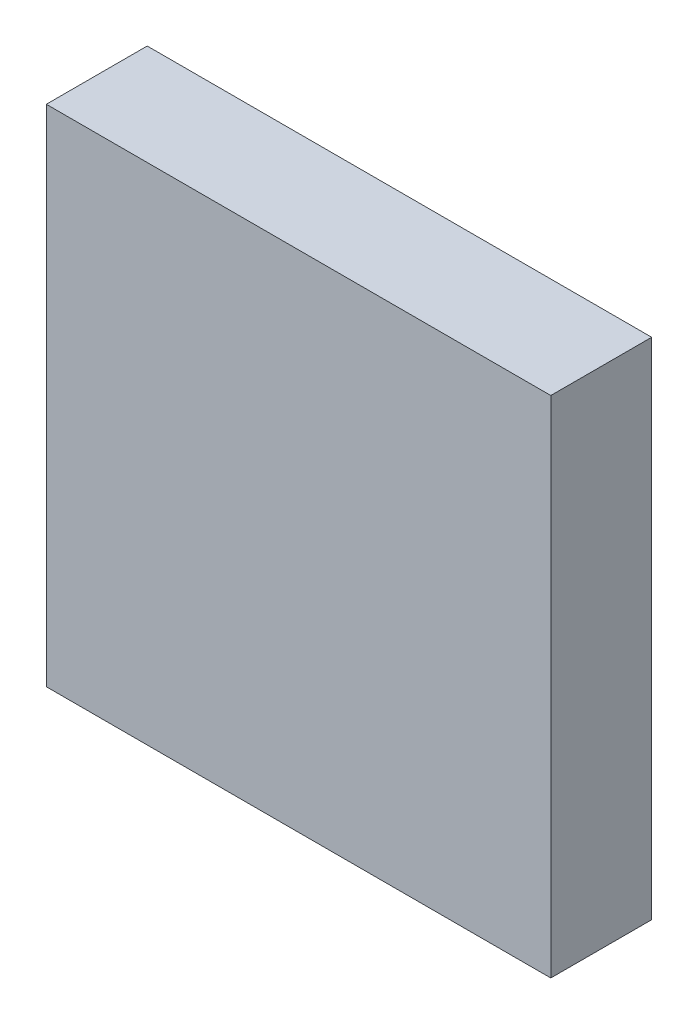
ISO-10303-21;
HEADER;
FILE_DESCRIPTION(('STEP AP214'),'2;1');
FILE_NAME('part.step','',(''),(''),'','','');
FILE_SCHEMA(('AUTOMOTIVE_DESIGN { 1 0 10303 214 1 1 1 1 }'));
ENDSEC;
DATA;
#1=APPLICATION_CONTEXT('core data for automotive mechanical design processes');
#2=APPLICATION_PROTOCOL_DEFINITION('international standard','automotive_design',2000,#1);
#3=PRODUCT_CONTEXT('',#1,'mechanical');
#4=PRODUCT('Part','Part','',(#3));
#5=PRODUCT_RELATED_PRODUCT_CATEGORY('part','',(#4));
#6=PRODUCT_DEFINITION_FORMATION('','',#4);
#7=PRODUCT_DEFINITION_CONTEXT('part definition',#1,'design');
#8=PRODUCT_DEFINITION('design','',#6,#7);
#9=PRODUCT_DEFINITION_SHAPE('','',#8);
#10=(LENGTH_UNIT() NAMED_UNIT(*) SI_UNIT(.MILLI.,.METRE.));
#11=(NAMED_UNIT(*) PLANE_ANGLE_UNIT() SI_UNIT($,.RADIAN.));
#12=(NAMED_UNIT(*) SI_UNIT($,.STERADIAN.) SOLID_ANGLE_UNIT());
#13=UNCERTAINTY_MEASURE_WITH_UNIT(LENGTH_MEASURE(1.E-05),#10,'distance_accuracy_value','');
#14=(GEOMETRIC_REPRESENTATION_CONTEXT(3) GLOBAL_UNCERTAINTY_ASSIGNED_CONTEXT((#13)) GLOBAL_UNIT_ASSIGNED_CONTEXT((#10,
#11,#12)) REPRESENTATION_CONTEXT('',''));
#15=CARTESIAN_POINT('',(0.,0.,0.));
#16=DIRECTION('',(0.,0.,1.));
#17=DIRECTION('',(1.,0.,0.));
#18=AXIS2_PLACEMENT_3D('',#15,#16,#17);
#19=CARTESIAN_POINT('',(10.,10.,4.));
#20=DIRECTION('',(-1.,0.,0.));
#21=DIRECTION('',(0.,0.,1.));
#22=AXIS2_PLACEMENT_3D('',#19,#20,#21);
#23=PLANE('',#22);
#24=DIRECTION('',(0.,1.,0.));
#25=VECTOR('',#24,1.);
#26=CARTESIAN_POINT('',(10.,10.,0.));
#27=LINE('',#26,#25);
#28=CARTESIAN_POINT('',(10.,-10.,0.));
#29=VERTEX_POINT('',#28);
#30=CARTESIAN_POINT('',(10.,10.,0.));
#31=VERTEX_POINT('',#30);
#32=EDGE_CURVE('E100',#29,#31,#27,.T.);
#33=ORIENTED_EDGE('',*,*,#32,.T.);
#34=DIRECTION('',(0.,0.,-1.));
#35=VECTOR('',#34,1.);
#36=CARTESIAN_POINT('',(10.,10.,4.));
#37=LINE('',#36,#35);
#38=CARTESIAN_POINT('',(10.,10.,4.));
#39=VERTEX_POINT('',#38);
#40=EDGE_CURVE('E11',#39,#31,#37,.T.);
#41=ORIENTED_EDGE('',*,*,#40,.F.);
#42=DIRECTION('',(0.,1.,0.));
#43=VECTOR('',#42,1.);
#44=CARTESIAN_POINT('',(10.,10.,4.));
#45=LINE('',#44,#43);
#46=CARTESIAN_POINT('',(10.,-10.,4.));
#47=VERTEX_POINT('',#46);
#48=EDGE_CURVE('E88',#47,#39,#45,.T.);
#49=ORIENTED_EDGE('',*,*,#48,.F.);
#50=DIRECTION('',(0.,0.,-1.));
#51=VECTOR('',#50,1.);
#52=CARTESIAN_POINT('',(10.,-10.,4.));
#53=LINE('',#52,#51);
#54=EDGE_CURVE('E96',#47,#29,#53,.T.);
#55=ORIENTED_EDGE('',*,*,#54,.T.);
#56=EDGE_LOOP('',(#33,#41,#49,#55));
#57=FACE_BOUND('',#56,.T.);
#58=ADVANCED_FACE('F37',(#57),#23,.F.);
#59=CARTESIAN_POINT('',(-10.,10.,4.));
#60=DIRECTION('',(0.,-1.,0.));
#61=DIRECTION('',(0.,0.,-1.));
#62=AXIS2_PLACEMENT_3D('',#59,#60,#61);
#63=PLANE('',#62);
#64=DIRECTION('',(-1.,0.,0.));
#65=VECTOR('',#64,1.);
#66=CARTESIAN_POINT('',(-10.,10.,0.));
#67=LINE('',#66,#65);
#68=CARTESIAN_POINT('',(-10.,10.,0.));
#69=VERTEX_POINT('',#68);
#70=EDGE_CURVE('E92',#31,#69,#67,.T.);
#71=ORIENTED_EDGE('',*,*,#70,.T.);
#72=DIRECTION('',(0.,0.,-1.));
#73=VECTOR('',#72,1.);
#74=CARTESIAN_POINT('',(-10.,10.,4.));
#75=LINE('',#74,#73);
#76=CARTESIAN_POINT('',(-10.,10.,4.));
#77=VERTEX_POINT('',#76);
#78=EDGE_CURVE('E45',#77,#69,#75,.T.);
#79=ORIENTED_EDGE('',*,*,#78,.F.);
#80=DIRECTION('',(-1.,0.,0.));
#81=VECTOR('',#80,1.);
#82=CARTESIAN_POINT('',(-10.,10.,4.));
#83=LINE('',#82,#81);
#84=EDGE_CURVE('E83',#39,#77,#83,.T.);
#85=ORIENTED_EDGE('',*,*,#84,.F.);
#86=ORIENTED_EDGE('',*,*,#40,.T.);
#87=EDGE_LOOP('',(#71,#79,#85,#86));
#88=FACE_BOUND('',#87,.T.);
#89=ADVANCED_FACE('F91',(#88),#63,.F.);
#90=CARTESIAN_POINT('',(-10.,10.,4.));
#91=DIRECTION('',(1.,0.,0.));
#92=DIRECTION('',(0.,1.,0.));
#93=AXIS2_PLACEMENT_3D('',#90,#91,#92);
#94=PLANE('',#93);
#95=DIRECTION('',(0.,-1.,0.));
#96=VECTOR('',#95,1.);
#97=CARTESIAN_POINT('',(-10.,10.,0.));
#98=LINE('',#97,#96);
#99=CARTESIAN_POINT('',(-10.,-10.,0.));
#100=VERTEX_POINT('',#99);
#101=EDGE_CURVE('E70',#69,#100,#98,.T.);
#102=ORIENTED_EDGE('',*,*,#101,.T.);
#103=DIRECTION('',(0.,0.,-1.));
#104=VECTOR('',#103,1.);
#105=CARTESIAN_POINT('',(-10.,-10.,4.));
#106=LINE('',#105,#104);
#107=CARTESIAN_POINT('',(-10.,-10.,4.));
#108=VERTEX_POINT('',#107);
#109=EDGE_CURVE('E93',#108,#100,#106,.T.);
#110=ORIENTED_EDGE('',*,*,#109,.F.);
#111=DIRECTION('',(0.,-1.,0.));
#112=VECTOR('',#111,1.);
#113=CARTESIAN_POINT('',(-10.,10.,4.));
#114=LINE('',#113,#112);
#115=EDGE_CURVE('E86',#77,#108,#114,.T.);
#116=ORIENTED_EDGE('',*,*,#115,.F.);
#117=ORIENTED_EDGE('',*,*,#78,.T.);
#118=EDGE_LOOP('',(#102,#110,#116,#117));
#119=FACE_BOUND('',#118,.T.);
#120=ADVANCED_FACE('F94',(#119),#94,.F.);
#121=CARTESIAN_POINT('',(-10.,-10.,4.));
#122=DIRECTION('',(0.,1.,0.));
#123=DIRECTION('',(0.,0.,1.));
#124=AXIS2_PLACEMENT_3D('',#121,#122,#123);
#125=PLANE('',#124);
#126=DIRECTION('',(1.,0.,0.));
#127=VECTOR('',#126,1.);
#128=CARTESIAN_POINT('',(-10.,-10.,0.));
#129=LINE('',#128,#127);
#130=EDGE_CURVE('E76',#100,#29,#129,.T.);
#131=ORIENTED_EDGE('',*,*,#130,.T.);
#132=ORIENTED_EDGE('',*,*,#54,.F.);
#133=DIRECTION('',(1.,0.,0.));
#134=VECTOR('',#133,1.);
#135=CARTESIAN_POINT('',(-10.,-10.,4.));
#136=LINE('',#135,#134);
#137=EDGE_CURVE('E53',#108,#47,#136,.T.);
#138=ORIENTED_EDGE('',*,*,#137,.F.);
#139=ORIENTED_EDGE('',*,*,#109,.T.);
#140=EDGE_LOOP('',(#131,#132,#138,#139));
#141=FACE_BOUND('',#140,.T.);
#142=ADVANCED_FACE('F107',(#141),#125,.F.);
#143=CARTESIAN_POINT('',(0.,0.,4.));
#144=DIRECTION('',(0.,0.,1.));
#145=DIRECTION('',(1.,0.,0.));
#146=AXIS2_PLACEMENT_3D('',#143,#144,#145);
#147=PLANE('',#146);
#148=ORIENTED_EDGE('',*,*,#48,.T.);
#149=ORIENTED_EDGE('',*,*,#84,.T.);
#150=ORIENTED_EDGE('',*,*,#115,.T.);
#151=ORIENTED_EDGE('',*,*,#137,.T.);
#152=EDGE_LOOP('',(#148,#149,#150,#151));
#153=FACE_BOUND('',#152,.T.);
#154=ADVANCED_FACE('F84',(#153),#147,.T.);
#155=CARTESIAN_POINT('',(0.,0.,0.));
#156=DIRECTION('',(0.,0.,1.));
#157=DIRECTION('',(1.,0.,0.));
#158=AXIS2_PLACEMENT_3D('',#155,#156,#157);
#159=PLANE('',#158);
#160=ORIENTED_EDGE('',*,*,#32,.F.);
#161=ORIENTED_EDGE('',*,*,#130,.F.);
#162=ORIENTED_EDGE('',*,*,#101,.F.);
#163=ORIENTED_EDGE('',*,*,#70,.F.);
#164=EDGE_LOOP('',(#160,#161,#162,#163));
#165=FACE_BOUND('',#164,.T.);
#166=ADVANCED_FACE('F110',(#165),#159,.F.);
#167=CLOSED_SHELL('',(#58,#89,#120,#142,#154,#166));
#168=MANIFOLD_SOLID_BREP('B2',#167);
#169=ADVANCED_BREP_SHAPE_REPRESENTATION('',(#18,#168),#14);
#170=SHAPE_DEFINITION_REPRESENTATION(#9,#169);
ENDSEC;
END-ISO-10303-21;
